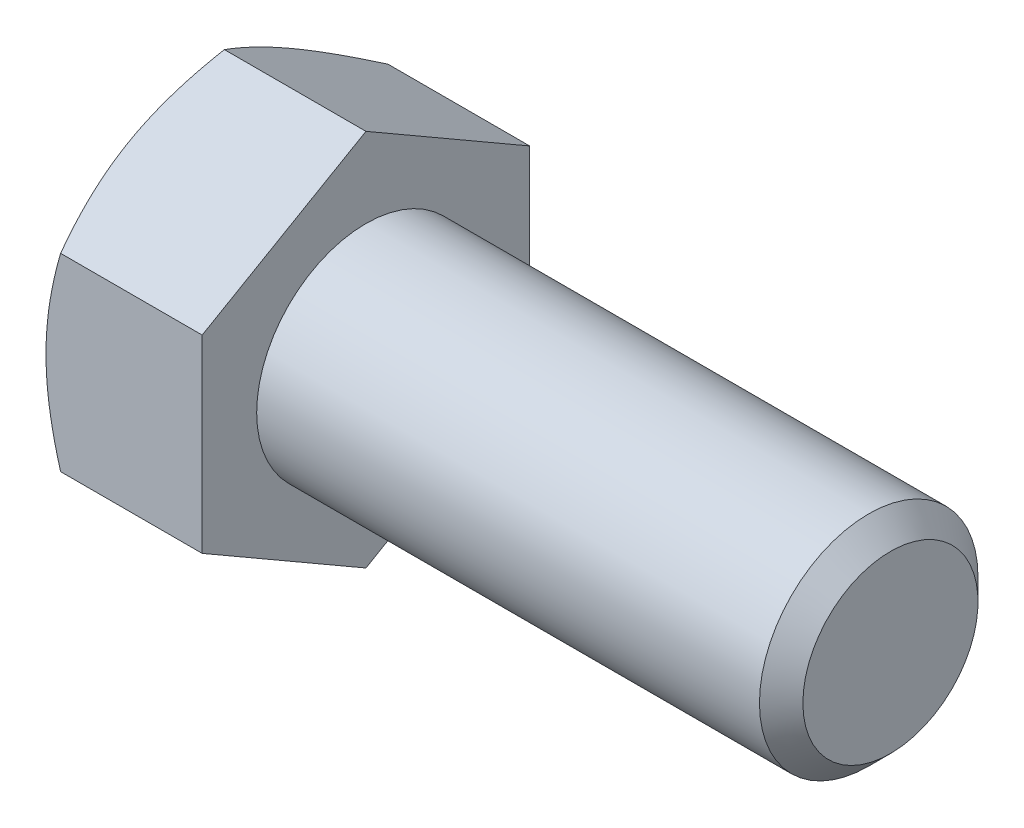
ISO-10303-21;
HEADER;
FILE_DESCRIPTION(('STEP AP214'),'2;1');
FILE_NAME('part.step','',(''),(''),'','','');
FILE_SCHEMA(('AUTOMOTIVE_DESIGN { 1 0 10303 214 1 1 1 1 }'));
ENDSEC;
DATA;
#1=APPLICATION_CONTEXT('core data for automotive mechanical design processes');
#2=APPLICATION_PROTOCOL_DEFINITION('international standard','automotive_design',2000,#1);
#3=PRODUCT_CONTEXT('',#1,'mechanical');
#4=PRODUCT('Part','Part','',(#3));
#5=PRODUCT_RELATED_PRODUCT_CATEGORY('part','',(#4));
#6=PRODUCT_DEFINITION_FORMATION('','',#4);
#7=PRODUCT_DEFINITION_CONTEXT('part definition',#1,'design');
#8=PRODUCT_DEFINITION('design','',#6,#7);
#9=PRODUCT_DEFINITION_SHAPE('','',#8);
#10=(LENGTH_UNIT() NAMED_UNIT(*) SI_UNIT(.MILLI.,.METRE.));
#11=(NAMED_UNIT(*) PLANE_ANGLE_UNIT() SI_UNIT($,.RADIAN.));
#12=(NAMED_UNIT(*) SI_UNIT($,.STERADIAN.) SOLID_ANGLE_UNIT());
#13=UNCERTAINTY_MEASURE_WITH_UNIT(LENGTH_MEASURE(1.E-05),#10,'distance_accuracy_value','');
#14=(GEOMETRIC_REPRESENTATION_CONTEXT(3) GLOBAL_UNCERTAINTY_ASSIGNED_CONTEXT((#13)) GLOBAL_UNIT_ASSIGNED_CONTEXT((#10,
#11,#12)) REPRESENTATION_CONTEXT('',''));
#15=CARTESIAN_POINT('',(0.,0.,0.));
#16=DIRECTION('',(0.,0.,1.));
#17=DIRECTION('',(1.,0.,0.));
#18=AXIS2_PLACEMENT_3D('',#15,#16,#17);
#19=CARTESIAN_POINT('',(6.8072,4.12077981131403,-7.1374));
#20=DIRECTION('',(0.,-0.866025403784438,0.500000000000001));
#21=DIRECTION('',(0.,-0.500000000000001,-0.866025403784438));
#22=AXIS2_PLACEMENT_3D('',#19,#20,#21);
#23=PLANE('',#22);
#24=CARTESIAN_POINT('',(0.637553523420348,8.24167509268191,0.000199999999999582));
#25=CARTESIAN_POINT('',(0.585265389565359,8.15109571898021,-0.156688077369111));
#26=CARTESIAN_POINT('',(0.535350289912886,8.06017862158373,-0.314161109336512));
#27=CARTESIAN_POINT('',(0.440919739394811,7.87760608276958,-0.630386022629451));
#28=CARTESIAN_POINT('',(0.396406617864103,7.78595034088604,-0.789138424377166));
#29=CARTESIAN_POINT('',(0.2718439466046,7.50951559742938,-1.26793744502137));
#30=CARTESIAN_POINT('',(0.200994122533562,7.32364541554993,-1.58987404364865));
#31=CARTESIAN_POINT('',(0.117914357261567,7.04549407114397,-2.07164630435335));
#32=CARTESIAN_POINT('',(0.0942473375753679,6.95404399131372,-2.23004248897558));
#33=CARTESIAN_POINT('',(0.0545611977075647,6.77073061920728,-2.54755056317072));
#34=CARTESIAN_POINT('',(0.0385414017966341,6.67886736416472,-2.70666238825308));
#35=CARTESIAN_POINT('',(0.0145579786669824,6.49498130931768,-3.02516237805154));
#36=CARTESIAN_POINT('',(0.00658520869042867,6.40295880983915,-3.18455002258784));
#37=CARTESIAN_POINT('',(-0.00114175893561541,6.21883388819856,-3.50346374180898));
#38=CARTESIAN_POINT('',(-0.000896210482461266,6.12673146859347,-3.66298981206503));
#39=CARTESIAN_POINT('',(0.0110730517201773,5.87440161908354,-4.10003793168242));
#40=CARTESIAN_POINT('',(0.0311658852990926,5.71425679021456,-4.37741691185292));
#41=CARTESIAN_POINT('',(0.0948800883359072,5.39503079963205,-4.93033254663834));
#42=CARTESIAN_POINT('',(0.13852323430896,5.23595076056063,-5.20586725678008));
#43=CARTESIAN_POINT('',(0.247618299095075,4.91608234409664,-5.75989560583231));
#44=CARTESIAN_POINT('',(0.31353243599271,4.75533432745402,-6.03831933787326));
#45=CARTESIAN_POINT('',(0.463130880450463,4.43623548204411,-6.59101475075978));
#46=CARTESIAN_POINT('',(0.546780048637372,4.27788056676996,-6.86529350964288));
#47=CARTESIAN_POINT('',(0.637553523420343,4.12066434126019,-7.1376));
#48=B_SPLINE_CURVE_WITH_KNOTS('',3,(#24,#25,#26,#27,#28,#29,#30,#31,#32,#33,#34,#35,#36,#37,#38,
#39,#40,#41,#42,#43,#44,#45,#46,#47),.UNSPECIFIED.,.F.,.F.,(4,2,2,2,2,2,2,2,2,2,2,4),(0.,
0.565616271543687,1.13147557690344,2.26554547664276,2.81869146049269,3.37178855781927,
3.9242565351942,4.47670744459711,5.43845614829341,6.40109569003608,7.3850851165131,
8.36714283329691),.UNSPECIFIED.);
#49=CARTESIAN_POINT('',(0.637486855352631,8.24155962262808,0.));
#50=VERTEX_POINT('',#49);
#51=CARTESIAN_POINT('',(0.,6.18116971697105,-3.56870000000001));
#52=VERTEX_POINT('',#51);
#53=EDGE_CURVE('E51',#50,#52,#48,.T.);
#54=ORIENTED_EDGE('',*,*,#53,.F.);
#55=DIRECTION('',(-1.,0.,0.));
#56=VECTOR('',#55,1.);
#57=CARTESIAN_POINT('',(6.8072,8.24155962262808,0.));
#58=LINE('',#57,#56);
#59=CARTESIAN_POINT('',(6.8072,8.24155962262808,0.));
#60=VERTEX_POINT('',#59);
#61=EDGE_CURVE('E147',#60,#50,#58,.T.);
#62=ORIENTED_EDGE('',*,*,#61,.F.);
#63=DIRECTION('',(0.,0.500000000000001,0.866025403784438));
#64=VECTOR('',#63,1.);
#65=CARTESIAN_POINT('',(6.8072,4.12077981131403,-7.1374));
#66=LINE('',#65,#64);
#67=CARTESIAN_POINT('',(6.8072,4.12077981131403,-7.1374));
#68=VERTEX_POINT('',#67);
#69=EDGE_CURVE('E232',#68,#60,#66,.T.);
#70=ORIENTED_EDGE('',*,*,#69,.F.);
#71=DIRECTION('',(-1.,0.,0.));
#72=VECTOR('',#71,1.);
#73=CARTESIAN_POINT('',(6.8072,4.12077981131403,-7.1374));
#74=LINE('',#73,#72);
#75=CARTESIAN_POINT('',(0.637486855352625,4.12077981131403,-7.1374));
#76=VERTEX_POINT('',#75);
#77=EDGE_CURVE('E135',#68,#76,#74,.T.);
#78=ORIENTED_EDGE('',*,*,#77,.T.);
#79=EDGE_CURVE('E129',#52,#76,#48,.T.);
#80=ORIENTED_EDGE('',*,*,#79,.F.);
#81=EDGE_LOOP('',(#54,#62,#70,#78,#80));
#82=FACE_BOUND('',#81,.T.);
#83=ADVANCED_FACE('F35',(#82),#23,.F.);
#84=CARTESIAN_POINT('',(6.8072,8.24155962262808,0.));
#85=DIRECTION('',(0.,-0.866025403784438,-0.500000000000001));
#86=DIRECTION('',(0.,0.500000000000001,-0.866025403784438));
#87=AXIS2_PLACEMENT_3D('',#84,#85,#86);
#88=PLANE('',#87);
#89=CARTESIAN_POINT('',(0.637553523420344,4.12066434126019,7.1376));
#90=CARTESIAN_POINT('',(0.585265389565354,4.21124371496189,6.98071192263089));
#91=CARTESIAN_POINT('',(0.535350289912882,4.30216081235838,6.82323889066349));
#92=CARTESIAN_POINT('',(0.440919739394807,4.48473335117252,6.50701397737055));
#93=CARTESIAN_POINT('',(0.3964066178641,4.57638909305606,6.34826157562283));
#94=CARTESIAN_POINT('',(0.271843946604597,4.85282383651273,5.86946255497863));
#95=CARTESIAN_POINT('',(0.20099412253356,5.03869401839218,5.54752595635135));
#96=CARTESIAN_POINT('',(0.117914357261566,5.31684536279814,5.06575369564665));
#97=CARTESIAN_POINT('',(0.094247337575367,5.40829544262839,4.90735751102442));
#98=CARTESIAN_POINT('',(0.0545611977075641,5.59160881473483,4.58984943682928));
#99=CARTESIAN_POINT('',(0.0385414017966333,5.68347206977738,4.43073761174692));
#100=CARTESIAN_POINT('',(0.0145579786669821,5.86735812462442,4.11223762194846));
#101=CARTESIAN_POINT('',(0.00658520869042904,5.95938062410295,3.95284997741216));
#102=CARTESIAN_POINT('',(-0.00114175893561427,6.14350554574354,3.63393625819102));
#103=CARTESIAN_POINT('',(-0.000896210482460006,6.23560796534864,3.47441018793497));
#104=CARTESIAN_POINT('',(0.0110730517201789,6.48793781485856,3.03736206831758));
#105=CARTESIAN_POINT('',(0.0311658852990944,6.64808264372754,2.75998308814708));
#106=CARTESIAN_POINT('',(0.0948800883359096,6.96730863431005,2.20706745336167));
#107=CARTESIAN_POINT('',(0.138523234308963,7.12638867338148,1.93153274321992));
#108=CARTESIAN_POINT('',(0.24761829909508,7.44625708984546,1.37750439416769));
#109=CARTESIAN_POINT('',(0.313532435992716,7.60700510648809,1.09908066212674));
#110=CARTESIAN_POINT('',(0.463130880450469,7.926103951898,0.546385249240216));
#111=CARTESIAN_POINT('',(0.546780048637379,8.08445886717215,0.272106490357122));
#112=CARTESIAN_POINT('',(0.637553523420349,8.24167509268191,-0.000199999999999955));
#113=B_SPLINE_CURVE_WITH_KNOTS('',3,(#89,#90,#91,#92,#93,#94,#95,#96,#97,#98,#99,#100,#101,#102,
#103,#104,#105,#106,#107,#108,#109,#110,#111,#112),.UNSPECIFIED.,.F.,.F.,(4,2,2,2,2,2,2,2,2,2,2,
4),(0.,0.565616271543686,1.13147557690344,2.26554547664276,2.81869146049269,3.37178855781927,
3.92425653519419,4.4767074445971,5.4384561482934,6.40109569003607,7.3850851165131,
8.36714283329691),.UNSPECIFIED.);
#114=CARTESIAN_POINT('',(0.637486855352626,4.12077981131403,7.1374));
#115=VERTEX_POINT('',#114);
#116=CARTESIAN_POINT('',(0.,6.18116971697105,3.56870000000001));
#117=VERTEX_POINT('',#116);
#118=EDGE_CURVE('E58',#115,#117,#113,.T.);
#119=ORIENTED_EDGE('',*,*,#118,.F.);
#120=DIRECTION('',(-1.,0.,0.));
#121=VECTOR('',#120,1.);
#122=CARTESIAN_POINT('',(6.8072,4.12077981131403,7.1374));
#123=LINE('',#122,#121);
#124=CARTESIAN_POINT('',(6.8072,4.12077981131403,7.1374));
#125=VERTEX_POINT('',#124);
#126=EDGE_CURVE('E145',#125,#115,#123,.T.);
#127=ORIENTED_EDGE('',*,*,#126,.F.);
#128=DIRECTION('',(0.,-0.500000000000001,0.866025403784438));
#129=VECTOR('',#128,1.);
#130=CARTESIAN_POINT('',(6.8072,8.24155962262808,0.));
#131=LINE('',#130,#129);
#132=EDGE_CURVE('E230',#60,#125,#131,.T.);
#133=ORIENTED_EDGE('',*,*,#132,.F.);
#134=ORIENTED_EDGE('',*,*,#61,.T.);
#135=EDGE_CURVE('E162',#117,#50,#113,.T.);
#136=ORIENTED_EDGE('',*,*,#135,.F.);
#137=EDGE_LOOP('',(#119,#127,#133,#134,#136));
#138=FACE_BOUND('',#137,.T.);
#139=ADVANCED_FACE('F168',(#138),#88,.F.);
#140=CARTESIAN_POINT('',(6.8072,4.12077981131403,7.1374));
#141=DIRECTION('',(0.,0.,-1.));
#142=DIRECTION('',(-1.,0.,0.));
#143=AXIS2_PLACEMENT_3D('',#140,#141,#142);
#144=PLANE('',#143);
#145=CARTESIAN_POINT('',(3.51793891464087,-11.1403587268437,7.1374));
#146=CARTESIAN_POINT('',(3.36611761361542,-10.8279722926893,7.1374));
#147=CARTESIAN_POINT('',(3.21573167435817,-10.5148763007017,7.1374));
#148=CARTESIAN_POINT('',(2.91863653133452,-9.88688803265219,7.1374));
#149=CARTESIAN_POINT('',(2.77192789362364,-9.57199548909054,7.1374));
#150=CARTESIAN_POINT('',(2.48227074397641,-8.93844907707202,7.1374));
#151=CARTESIAN_POINT('',(2.33934643030355,-8.61978410734441,7.1374));
#152=CARTESIAN_POINT('',(2.05925336317275,-7.97994405772779,7.1374));
#153=CARTESIAN_POINT('',(1.92208434228597,-7.65876909529408,7.1374));
#154=CARTESIAN_POINT('',(1.65065378230837,-7.00284865103085,7.1374));
#155=CARTESIAN_POINT('',(1.51663374065787,-6.66800268560584,7.1374));
#156=CARTESIAN_POINT('',(1.25856485288051,-5.99442084818065,7.1374));
#157=CARTESIAN_POINT('',(1.13451711533335,-5.6556845484785,7.1374));
#158=CARTESIAN_POINT('',(0.899596727677592,-4.97438980758155,7.1374));
#159=CARTESIAN_POINT('',(0.78869803674292,-4.63184044199148,7.1374));
#160=CARTESIAN_POINT('',(0.583585288609215,-3.94184101121261,7.1374));
#161=CARTESIAN_POINT('',(0.489366053461915,-3.5943925031972,7.1374));
#162=CARTESIAN_POINT('',(0.322585119775289,-2.89623643412328,7.1374));
#163=CARTESIAN_POINT('',(0.249906108267923,-2.54555766855628,7.1374));
#164=CARTESIAN_POINT('',(0.160162927876226,-2.01629019056175,7.1374));
#165=CARTESIAN_POINT('',(0.133459926561135,-1.83931395899738,7.1374));
#166=CARTESIAN_POINT('',(0.0870009608751859,-1.48445773938035,7.1374));
#167=CARTESIAN_POINT('',(0.0672443235865576,-1.3065778405635,7.1374));
#168=CARTESIAN_POINT('',(0.0353233928817906,-0.952509042934671,7.1374));
#169=CARTESIAN_POINT('',(0.023062060656036,-0.776328928434241,7.1374));
#170=CARTESIAN_POINT('',(0.00600431660240745,-0.423607840789669,7.1374));
#171=CARTESIAN_POINT('',(0.00120777872271182,-0.247066873789353,7.1374));
#172=CARTESIAN_POINT('',(-0.000805707966080717,0.106061109313543,7.1374));
#173=CARTESIAN_POINT('',(0.00197740745485924,0.282648125793668,7.1374));
#174=CARTESIAN_POINT('',(0.015054364225325,0.635545980126708,7.1374));
#175=CARTESIAN_POINT('',(0.0253485677088154,0.811856804252741,7.1374));
#176=CARTESIAN_POINT('',(0.0587173546676621,1.23335791869126,7.1374));
#177=CARTESIAN_POINT('',(0.0852317102922988,1.47828183508495,7.1374));
#178=CARTESIAN_POINT('',(0.151325348901078,1.96634766484074,7.1374));
#179=CARTESIAN_POINT('',(0.190906342916657,2.20948934056,7.1374));
#180=CARTESIAN_POINT('',(0.327153349211707,2.93593608611635,7.1374));
#181=CARTESIAN_POINT('',(0.441300495017733,3.41600789467397,7.1374));
#182=CARTESIAN_POINT('',(0.639740105584513,4.13409780337111,7.1374));
#183=CARTESIAN_POINT('',(0.71138683927974,4.37582477933243,7.1374));
#184=CARTESIAN_POINT('',(0.862240726867138,4.85693123459408,7.1374));
#185=CARTESIAN_POINT('',(0.941447936163006,5.09631069667749,7.1374));
#186=CARTESIAN_POINT('',(1.10614180608764,5.57279746249284,7.1374));
#187=CARTESIAN_POINT('',(1.19162653724197,5.809905439274,7.1374));
#188=CARTESIAN_POINT('',(1.36785754588297,6.28214651090287,7.1374));
#189=CARTESIAN_POINT('',(1.4586037216663,6.51727964382365,7.1374));
#190=CARTESIAN_POINT('',(1.70099135878086,7.12822933634872,7.1374));
#191=CARTESIAN_POINT('',(1.85611245200932,7.50266378649049,7.1374));
#192=CARTESIAN_POINT('',(2.17492034788947,8.24788094227112,7.1374));
#193=CARTESIAN_POINT('',(2.338607954525,8.61866330125998,7.1374));
#194=CARTESIAN_POINT('',(2.67260301704527,9.35737269718075,7.1374));
#195=CARTESIAN_POINT('',(2.8429126440593,9.7252987493811,7.1374));
#196=CARTESIAN_POINT('',(3.18863367809308,10.4587232704181,7.1374));
#197=CARTESIAN_POINT('',(3.36404491157502,10.8242218213112,7.1374));
#198=CARTESIAN_POINT('',(3.7191549662705,11.553777334436,7.1374));
#199=CARTESIAN_POINT('',(3.89885959822867,11.9178314626509,7.1374));
#200=CARTESIAN_POINT('',(4.26150568432078,12.6443245246618,7.1374));
#201=CARTESIAN_POINT('',(4.44444716083244,13.0067634472695,7.1374));
#202=CARTESIAN_POINT('',(4.81291716764717,13.7302353242129,7.1374));
#203=CARTESIAN_POINT('',(4.99844519827985,14.0912685333268,7.1374));
#204=CARTESIAN_POINT('',(5.37165471040538,14.8122208146436,7.1374));
#205=CARTESIAN_POINT('',(5.55933620037512,15.1721398824536,7.1374));
#206=CARTESIAN_POINT('',(6.08751400276291,16.1789579520409,7.1374));
#207=CARTESIAN_POINT('',(6.43000254365915,16.8248116492745,7.1374));
#208=CARTESIAN_POINT('',(7.11919785487999,18.1143032770824,7.1374));
#209=CARTESIAN_POINT('',(7.46590484738288,18.7579410886393,7.1374));
#210=CARTESIAN_POINT('',(8.16140637459832,20.0415314633598,7.1374));
#211=CARTESIAN_POINT('',(8.51019123426674,20.6814892741016,7.1374));
#212=CARTESIAN_POINT('',(9.21019417047445,21.9600146152104,7.1374));
#213=CARTESIAN_POINT('',(9.56141207357471,22.598582240497,7.1374));
#214=CARTESIAN_POINT('',(9.9135191344137,23.2366555668876,7.1374));
#215=B_SPLINE_CURVE_WITH_KNOTS('',3,(#145,#146,#147,#148,#149,#150,#151,#152,#153,#154,#155,
#156,#157,#158,#159,#160,#161,#162,#163,#164,#165,#166,#167,#168,#169,#170,#171,#172,#173,#174,
#175,#176,#177,#178,#179,#180,#181,#182,#183,#184,#185,#186,#187,#188,#189,#190,#191,#192,#193,
#194,#195,#196,#197,#198,#199,#200,#201,#202,#203,#204,#205,#206,#207,#208,#209,#210,#211,#212,
#213,#214),.UNSPECIFIED.,.F.,.F.,(4,2,2,2,2,2,2,2,2,2,2,2,2,2,2,2,2,2,2,2,2,2,2,2,2,2,2,2,2,2,2,
2,2,2,4),(0.,1.0419888362068,2.08413709519682,3.13183784368231,4.17948985504911,
5.26137797247103,6.34338619307611,7.42321444996099,8.50270689628368,9.57620733057732,
10.113030795566,10.6498022423129,11.179468394122,11.7091256017988,12.2387872978086,
12.7684745322176,13.5071235743819,14.245869378494,15.7241255438818,16.4804246089875,
17.2367292167316,17.9928023300467,18.7488608333938,19.9645892594812,21.1804319893616,
22.3966767697582,23.6128802262777,24.8308351286452,26.0487984545624,27.2665296678531,
28.4842656762731,30.6773737382255,32.8705978115956,35.0570894097064,37.2434267159856),.UNSPECIFIED.);
#216=CARTESIAN_POINT('',(0.637486855352626,-4.12077981131403,7.1374));
#217=VERTEX_POINT('',#216);
#218=CARTESIAN_POINT('',(0.,0.,7.1374));
#219=VERTEX_POINT('',#218);
#220=EDGE_CURVE('E242',#217,#219,#215,.T.);
#221=ORIENTED_EDGE('',*,*,#220,.F.);
#222=DIRECTION('',(-1.,0.,0.));
#223=VECTOR('',#222,1.);
#224=CARTESIAN_POINT('',(6.8072,-4.12077981131403,7.1374));
#225=LINE('',#224,#223);
#226=CARTESIAN_POINT('',(6.8072,-4.12077981131403,7.1374));
#227=VERTEX_POINT('',#226);
#228=EDGE_CURVE('E137',#227,#217,#225,.T.);
#229=ORIENTED_EDGE('',*,*,#228,.F.);
#230=DIRECTION('',(0.,-1.,0.));
#231=VECTOR('',#230,1.);
#232=CARTESIAN_POINT('',(6.8072,4.12077981131403,7.1374));
#233=LINE('',#232,#231);
#234=EDGE_CURVE('E226',#125,#227,#233,.T.);
#235=ORIENTED_EDGE('',*,*,#234,.F.);
#236=ORIENTED_EDGE('',*,*,#126,.T.);
#237=EDGE_CURVE('E184',#219,#115,#215,.T.);
#238=ORIENTED_EDGE('',*,*,#237,.F.);
#239=EDGE_LOOP('',(#221,#229,#235,#236,#238));
#240=FACE_BOUND('',#239,.T.);
#241=ADVANCED_FACE('F248',(#240),#144,.F.);
#242=CARTESIAN_POINT('',(6.8072,-8.24155962262808,0.));
#243=DIRECTION('',(0.,0.866025403784438,-0.500000000000002));
#244=DIRECTION('',(0.,0.500000000000002,0.866025403784438));
#245=AXIS2_PLACEMENT_3D('',#242,#243,#244);
#246=PLANE('',#245);
#247=CARTESIAN_POINT('',(0.637553523420353,-8.24167509268192,-0.000200000000000067));
#248=CARTESIAN_POINT('',(0.585265389565364,-8.15109571898022,0.15668807736911));
#249=CARTESIAN_POINT('',(0.535350289912891,-8.06017862158374,0.314161109336512));
#250=CARTESIAN_POINT('',(0.440919739394815,-7.87760608276959,0.63038602262945));
#251=CARTESIAN_POINT('',(0.396406617864107,-7.78595034088605,0.789138424377166));
#252=CARTESIAN_POINT('',(0.271843946604603,-7.50951559742939,1.26793744502137));
#253=CARTESIAN_POINT('',(0.200994122533565,-7.32364541554993,1.58987404364865));
#254=CARTESIAN_POINT('',(0.11791435726157,-7.04549407114397,2.07164630435335));
#255=CARTESIAN_POINT('',(0.0942473375753707,-6.95404399131372,2.23004248897558));
#256=CARTESIAN_POINT('',(0.0545611977075674,-6.77073061920728,2.54755056317072));
#257=CARTESIAN_POINT('',(0.0385414017966367,-6.67886736416473,2.70666238825308));
#258=CARTESIAN_POINT('',(0.0145579786669845,-6.49498130931769,3.02516237805154));
#259=CARTESIAN_POINT('',(0.00658520869043039,-6.40295880983915,3.18455002258784));
#260=CARTESIAN_POINT('',(-0.00114175893561386,-6.21883388819856,3.50346374180898));
#261=CARTESIAN_POINT('',(-0.000896210482459503,-6.12673146859347,3.66298981206503));
#262=CARTESIAN_POINT('',(0.011073051720179,-5.87440161908355,4.10003793168242));
#263=CARTESIAN_POINT('',(0.0311658852990936,-5.71425679021456,4.37741691185292));
#264=CARTESIAN_POINT('',(0.0948800883359078,-5.39503079963205,4.93033254663834));
#265=CARTESIAN_POINT('',(0.138523234308961,-5.23595076056063,5.20586725678008));
#266=CARTESIAN_POINT('',(0.247618299095076,-4.91608234409664,5.75989560583231));
#267=CARTESIAN_POINT('',(0.313532435992711,-4.75533432745402,6.03831933787326));
#268=CARTESIAN_POINT('',(0.463130880450463,-4.43623548204411,6.59101475075978));
#269=CARTESIAN_POINT('',(0.546780048637372,-4.27788056676996,6.86529350964288));
#270=CARTESIAN_POINT('',(0.637553523420342,-4.12066434126019,7.1376));
#271=B_SPLINE_CURVE_WITH_KNOTS('',3,(#247,#248,#249,#250,#251,#252,#253,#254,#255,#256,#257,
#258,#259,#260,#261,#262,#263,#264,#265,#266,#267,#268,#269,#270),.UNSPECIFIED.,.F.,.F.,(4,2,2,
2,2,2,2,2,2,2,2,4),(0.,0.565616271543688,1.13147557690344,2.26554547664277,2.81869146049269,
3.37178855781927,3.9242565351942,4.47670744459711,5.43845614829341,6.40109569003608,
7.38508511651311,8.36714283329692),.UNSPECIFIED.);
#272=CARTESIAN_POINT('',(0.637486855352636,-8.24155962262808,0.));
#273=VERTEX_POINT('',#272);
#274=CARTESIAN_POINT('',(0.,-6.18116971697104,3.56870000000001));
#275=VERTEX_POINT('',#274);
#276=EDGE_CURVE('E170',#273,#275,#271,.T.);
#277=ORIENTED_EDGE('',*,*,#276,.F.);
#278=DIRECTION('',(-1.,0.,0.));
#279=VECTOR('',#278,1.);
#280=CARTESIAN_POINT('',(6.8072,-8.24155962262808,0.));
#281=LINE('',#280,#279);
#282=CARTESIAN_POINT('',(6.8072,-8.24155962262808,0.));
#283=VERTEX_POINT('',#282);
#284=EDGE_CURVE('E134',#283,#273,#281,.T.);
#285=ORIENTED_EDGE('',*,*,#284,.F.);
#286=DIRECTION('',(0.,-0.500000000000002,-0.866025403784438));
#287=VECTOR('',#286,1.);
#288=CARTESIAN_POINT('',(6.8072,-8.24155962262808,0.));
#289=LINE('',#288,#287);
#290=EDGE_CURVE('E224',#227,#283,#289,.T.);
#291=ORIENTED_EDGE('',*,*,#290,.F.);
#292=ORIENTED_EDGE('',*,*,#228,.T.);
#293=EDGE_CURVE('E172',#275,#217,#271,.T.);
#294=ORIENTED_EDGE('',*,*,#293,.F.);
#295=EDGE_LOOP('',(#277,#285,#291,#292,#294));
#296=FACE_BOUND('',#295,.T.);
#297=ADVANCED_FACE('F220',(#296),#246,.F.);
#298=CARTESIAN_POINT('',(6.8072,-4.12077981131404,-7.1374));
#299=DIRECTION('',(0.,0.866025403784438,0.500000000000001));
#300=DIRECTION('',(0.,-0.500000000000001,0.866025403784438));
#301=AXIS2_PLACEMENT_3D('',#298,#299,#300);
#302=PLANE('',#301);
#303=CARTESIAN_POINT('',(0.637553523420347,-4.12066434126021,-7.1376));
#304=CARTESIAN_POINT('',(0.585265389565358,-4.2112437149619,-6.98071192263089));
#305=CARTESIAN_POINT('',(0.535350289912886,-4.30216081235839,-6.82323889066349));
#306=CARTESIAN_POINT('',(0.440919739394811,-4.48473335117254,-6.50701397737055));
#307=CARTESIAN_POINT('',(0.396406617864103,-4.57638909305608,-6.34826157562283));
#308=CARTESIAN_POINT('',(0.271843946604601,-4.85282383651274,-5.86946255497863));
#309=CARTESIAN_POINT('',(0.200994122533564,-5.03869401839219,-5.54752595635135));
#310=CARTESIAN_POINT('',(0.11791435726157,-5.31684536279815,-5.06575369564664));
#311=CARTESIAN_POINT('',(0.0942473375753706,-5.4082954426284,-4.90735751102441));
#312=CARTESIAN_POINT('',(0.0545611977075683,-5.59160881473484,-4.58984943682928));
#313=CARTESIAN_POINT('',(0.0385414017966383,-5.68347206977739,-4.43073761174692));
#314=CARTESIAN_POINT('',(0.0145579786669876,-5.86735812462443,-4.11223762194845));
#315=CARTESIAN_POINT('',(0.00658520869043416,-5.95938062410297,-3.95284997741216));
#316=CARTESIAN_POINT('',(-0.00114175893560937,-6.14350554574356,-3.63393625819102));
#317=CARTESIAN_POINT('',(-0.000896210482454987,-6.23560796534865,-3.47441018793497));
#318=CARTESIAN_POINT('',(0.0110730517201842,-6.48793781485857,-3.03736206831757));
#319=CARTESIAN_POINT('',(0.0311658852990998,-6.64808264372755,-2.75998308814708));
#320=CARTESIAN_POINT('',(0.0948800883359153,-6.96730863431006,-2.20706745336166));
#321=CARTESIAN_POINT('',(0.138523234308969,-7.12638867338149,-1.93153274321992));
#322=CARTESIAN_POINT('',(0.247618299095085,-7.44625708984547,-1.37750439416769));
#323=CARTESIAN_POINT('',(0.313532435992721,-7.6070051064881,-1.09908066212674));
#324=CARTESIAN_POINT('',(0.463130880450474,-7.92610395189801,-0.546385249240215));
#325=CARTESIAN_POINT('',(0.546780048637383,-8.08445886717216,-0.272106490357122));
#326=CARTESIAN_POINT('',(0.637553523420353,-8.24167509268192,0.000200000000000249));
#327=B_SPLINE_CURVE_WITH_KNOTS('',3,(#303,#304,#305,#306,#307,#308,#309,#310,#311,#312,#313,
#314,#315,#316,#317,#318,#319,#320,#321,#322,#323,#324,#325,#326),.UNSPECIFIED.,.F.,.F.,(4,2,2,
2,2,2,2,2,2,2,2,4),(0.,0.565616271543688,1.13147557690344,2.26554547664276,2.81869146049269,
3.37178855781927,3.9242565351942,4.4767074445971,5.43845614829341,6.40109569003607,
7.3850851165131,8.36714283329691),.UNSPECIFIED.);
#328=CARTESIAN_POINT('',(0.63748685535263,-4.12077981131404,-7.1374));
#329=VERTEX_POINT('',#328);
#330=CARTESIAN_POINT('',(0.,-6.18116971697105,-3.5687));
#331=VERTEX_POINT('',#330);
#332=EDGE_CURVE('E111',#329,#331,#327,.T.);
#333=ORIENTED_EDGE('',*,*,#332,.F.);
#334=DIRECTION('',(-1.,0.,0.));
#335=VECTOR('',#334,1.);
#336=CARTESIAN_POINT('',(6.8072,-4.12077981131404,-7.1374));
#337=LINE('',#336,#335);
#338=CARTESIAN_POINT('',(6.8072,-4.12077981131404,-7.1374));
#339=VERTEX_POINT('',#338);
#340=EDGE_CURVE('E125',#339,#329,#337,.T.);
#341=ORIENTED_EDGE('',*,*,#340,.F.);
#342=DIRECTION('',(0.,0.500000000000001,-0.866025403784438));
#343=VECTOR('',#342,1.);
#344=CARTESIAN_POINT('',(6.8072,-4.12077981131404,-7.1374));
#345=LINE('',#344,#343);
#346=EDGE_CURVE('E222',#283,#339,#345,.T.);
#347=ORIENTED_EDGE('',*,*,#346,.F.);
#348=ORIENTED_EDGE('',*,*,#284,.T.);
#349=EDGE_CURVE('E128',#331,#273,#327,.T.);
#350=ORIENTED_EDGE('',*,*,#349,.F.);
#351=EDGE_LOOP('',(#333,#341,#347,#348,#350));
#352=FACE_BOUND('',#351,.T.);
#353=ADVANCED_FACE('F123',(#352),#302,.F.);
#354=CARTESIAN_POINT('',(6.8072,4.12077981131403,-7.1374));
#355=DIRECTION('',(0.,0.,1.));
#356=DIRECTION('',(1.,0.,0.));
#357=AXIS2_PLACEMENT_3D('',#354,#355,#356);
#358=PLANE('',#357);
#359=CARTESIAN_POINT('',(3.51793891464088,-11.1403587268438,-7.1374));
#360=CARTESIAN_POINT('',(3.36611761361543,-10.8279722926893,-7.1374));
#361=CARTESIAN_POINT('',(3.21573167435818,-10.5148763007017,-7.1374));
#362=CARTESIAN_POINT('',(2.91863653133453,-9.88688803265221,-7.1374));
#363=CARTESIAN_POINT('',(2.77192789362365,-9.57199548909056,-7.1374));
#364=CARTESIAN_POINT('',(2.48227074397642,-8.93844907707204,-7.1374));
#365=CARTESIAN_POINT('',(2.33934643030356,-8.61978410734443,-7.1374));
#366=CARTESIAN_POINT('',(2.05925336317276,-7.97994405772781,-7.1374));
#367=CARTESIAN_POINT('',(1.92208434228598,-7.65876909529411,-7.1374));
#368=CARTESIAN_POINT('',(1.65065378230838,-7.00284865103087,-7.1374));
#369=CARTESIAN_POINT('',(1.51663374065788,-6.66800268560586,-7.1374));
#370=CARTESIAN_POINT('',(1.25856485288051,-5.99442084818067,-7.1374));
#371=CARTESIAN_POINT('',(1.13451711533335,-5.65568454847852,-7.1374));
#372=CARTESIAN_POINT('',(0.899596727677598,-4.97438980758156,-7.1374));
#373=CARTESIAN_POINT('',(0.788698036742925,-4.6318404419915,-7.1374));
#374=CARTESIAN_POINT('',(0.583585288609219,-3.94184101121262,-7.1374));
#375=CARTESIAN_POINT('',(0.489366053461919,-3.59439250319721,-7.1374));
#376=CARTESIAN_POINT('',(0.322585119775292,-2.8962364341233,-7.1374));
#377=CARTESIAN_POINT('',(0.249906108267925,-2.54555766855629,-7.1374));
#378=CARTESIAN_POINT('',(0.160162927876228,-2.01629019056176,-7.1374));
#379=CARTESIAN_POINT('',(0.133459926561136,-1.8393139589974,-7.1374));
#380=CARTESIAN_POINT('',(0.0870009608751871,-1.48445773938036,-7.1374));
#381=CARTESIAN_POINT('',(0.0672443235865584,-1.30657784056351,-7.1374));
#382=CARTESIAN_POINT('',(0.0353233928817909,-0.952509042934684,-7.1374));
#383=CARTESIAN_POINT('',(0.0230620606560362,-0.776328928434254,-7.1374));
#384=CARTESIAN_POINT('',(0.0060043166024073,-0.423607840789682,-7.1374));
#385=CARTESIAN_POINT('',(0.00120777872271151,-0.247066873789366,-7.1374));
#386=CARTESIAN_POINT('',(-0.000805707966081406,0.10606110931353,-7.1374));
#387=CARTESIAN_POINT('',(0.00197740745485832,0.282648125793655,-7.1374));
#388=CARTESIAN_POINT('',(0.0150543642253239,0.635545980126695,-7.1374));
#389=CARTESIAN_POINT('',(0.0253485677088145,0.811856804252728,-7.1374));
#390=CARTESIAN_POINT('',(0.058717354667661,1.23335791869125,-7.1374));
#391=CARTESIAN_POINT('',(0.0852317102922972,1.47828183508493,-7.1374));
#392=CARTESIAN_POINT('',(0.151325348901076,1.96634766484072,-7.1374));
#393=CARTESIAN_POINT('',(0.190906342916654,2.20948934055998,-7.1374));
#394=CARTESIAN_POINT('',(0.327153349211703,2.93593608611633,-7.1374));
#395=CARTESIAN_POINT('',(0.441300495017729,3.41600789467395,-7.1374));
#396=CARTESIAN_POINT('',(0.639740105584508,4.13409780337109,-7.1374));
#397=CARTESIAN_POINT('',(0.711386839279735,4.37582477933241,-7.1374));
#398=CARTESIAN_POINT('',(0.862240726867132,4.85693123459407,-7.1374));
#399=CARTESIAN_POINT('',(0.941447936163,5.09631069667747,-7.1374));
#400=CARTESIAN_POINT('',(1.10614180608763,5.57279746249282,-7.1374));
#401=CARTESIAN_POINT('',(1.19162653724196,5.80990543927398,-7.1374));
#402=CARTESIAN_POINT('',(1.36785754588296,6.28214651090285,-7.1374));
#403=CARTESIAN_POINT('',(1.4586037216663,6.51727964382363,-7.1374));
#404=CARTESIAN_POINT('',(1.70099135878086,7.1282293363487,-7.1374));
#405=CARTESIAN_POINT('',(1.85611245200931,7.50266378649047,-7.1374));
#406=CARTESIAN_POINT('',(2.17492034788947,8.2478809422711,-7.1374));
#407=CARTESIAN_POINT('',(2.338607954525,8.61866330125997,-7.1374));
#408=CARTESIAN_POINT('',(2.67260301704526,9.35737269718074,-7.1374));
#409=CARTESIAN_POINT('',(2.8429126440593,9.72529874938109,-7.1374));
#410=CARTESIAN_POINT('',(3.18863367809308,10.4587232704181,-7.1374));
#411=CARTESIAN_POINT('',(3.36404491157501,10.8242218213111,-7.1374));
#412=CARTESIAN_POINT('',(3.7191549662705,11.553777334436,-7.1374));
#413=CARTESIAN_POINT('',(3.89885959822867,11.9178314626509,-7.1374));
#414=CARTESIAN_POINT('',(4.26150568432077,12.6443245246618,-7.1374));
#415=CARTESIAN_POINT('',(4.44444716083244,13.0067634472695,-7.1374));
#416=CARTESIAN_POINT('',(4.81291716764717,13.7302353242129,-7.1374));
#417=CARTESIAN_POINT('',(4.99844519827985,14.0912685333268,-7.1374));
#418=CARTESIAN_POINT('',(5.37165471040538,14.8122208146436,-7.1374));
#419=CARTESIAN_POINT('',(5.55933620037512,15.1721398824536,-7.1374));
#420=CARTESIAN_POINT('',(6.08751400276291,16.1789579520409,-7.1374));
#421=CARTESIAN_POINT('',(6.43000254365915,16.8248116492745,-7.1374));
#422=CARTESIAN_POINT('',(7.11919785487998,18.1143032770824,-7.1374));
#423=CARTESIAN_POINT('',(7.46590484738288,18.7579410886393,-7.1374));
#424=CARTESIAN_POINT('',(8.16140637459832,20.0415314633598,-7.1374));
#425=CARTESIAN_POINT('',(8.51019123426675,20.6814892741017,-7.1374));
#426=CARTESIAN_POINT('',(9.21019417047446,21.9600146152104,-7.1374));
#427=CARTESIAN_POINT('',(9.56141207357472,22.598582240497,-7.1374));
#428=CARTESIAN_POINT('',(9.9135191344137,23.2366555668876,-7.1374));
#429=B_SPLINE_CURVE_WITH_KNOTS('',3,(#359,#360,#361,#362,#363,#364,#365,#366,#367,#368,#369,
#370,#371,#372,#373,#374,#375,#376,#377,#378,#379,#380,#381,#382,#383,#384,#385,#386,#387,#388,
#389,#390,#391,#392,#393,#394,#395,#396,#397,#398,#399,#400,#401,#402,#403,#404,#405,#406,#407,
#408,#409,#410,#411,#412,#413,#414,#415,#416,#417,#418,#419,#420,#421,#422,#423,#424,#425,#426,
#427,#428),.UNSPECIFIED.,.F.,.F.,(4,2,2,2,2,2,2,2,2,2,2,2,2,2,2,2,2,2,2,2,2,2,2,2,2,2,2,2,2,2,2,
2,2,2,4),(0.,1.0419888362068,2.08413709519682,3.13183784368231,4.17948985504911,
5.26137797247103,6.34338619307611,7.42321444996099,8.50270689628369,9.57620733057733,
10.113030795566,10.6498022423129,11.179468394122,11.7091256017988,12.2387872978086,
12.7684745322176,13.507123574382,14.245869378494,15.7241255438818,16.4804246089875,
17.2367292167316,17.9928023300467,18.7488608333938,19.9645892594812,21.1804319893616,
22.3966767697582,23.6128802262777,24.8308351286452,26.0487984545625,27.2665296678531,
28.4842656762731,30.6773737382256,32.8705978115956,35.0570894097065,37.2434267159856),.UNSPECIFIED.);
#430=CARTESIAN_POINT('',(0.,0.,-7.1374));
#431=VERTEX_POINT('',#430);
#432=EDGE_CURVE('E117',#76,#431,#429,.F.);
#433=ORIENTED_EDGE('',*,*,#432,.F.);
#434=ORIENTED_EDGE('',*,*,#77,.F.);
#435=DIRECTION('',(0.,1.,0.));
#436=VECTOR('',#435,1.);
#437=CARTESIAN_POINT('',(6.8072,4.12077981131403,-7.1374));
#438=LINE('',#437,#436);
#439=EDGE_CURVE('E133',#339,#68,#438,.T.);
#440=ORIENTED_EDGE('',*,*,#439,.F.);
#441=ORIENTED_EDGE('',*,*,#340,.T.);
#442=EDGE_CURVE('E108',#431,#329,#429,.F.);
#443=ORIENTED_EDGE('',*,*,#442,.F.);
#444=EDGE_LOOP('',(#433,#434,#440,#441,#443));
#445=FACE_BOUND('',#444,.T.);
#446=ADVANCED_FACE('F131',(#445),#358,.F.);
#447=CARTESIAN_POINT('',(6.8072,8.24155962262808,0.));
#448=DIRECTION('',(1.,0.,0.));
#449=DIRECTION('',(0.,0.,-1.));
#450=AXIS2_PLACEMENT_3D('',#447,#448,#449);
#451=PLANE('',#450);
#452=CARTESIAN_POINT('',(6.8072,0.,0.));
#453=DIRECTION('',(1.,0.,0.));
#454=DIRECTION('',(0.,0.,-1.));
#455=AXIS2_PLACEMENT_3D('',#452,#453,#454);
#456=CIRCLE('',#455,4.7625);
#457=CARTESIAN_POINT('',(6.8072,0.,-4.7625));
#458=VERTEX_POINT('',#457);
#459=EDGE_CURVE('E235',#458,#458,#456,.F.);
#460=ORIENTED_EDGE('',*,*,#459,.T.);
#461=EDGE_LOOP('',(#460));
#462=FACE_BOUND('',#461,.T.);
#463=ORIENTED_EDGE('',*,*,#69,.T.);
#464=ORIENTED_EDGE('',*,*,#132,.T.);
#465=ORIENTED_EDGE('',*,*,#234,.T.);
#466=ORIENTED_EDGE('',*,*,#290,.T.);
#467=ORIENTED_EDGE('',*,*,#346,.T.);
#468=ORIENTED_EDGE('',*,*,#439,.T.);
#469=EDGE_LOOP('',(#463,#464,#465,#466,#467,#468));
#470=FACE_BOUND('',#469,.T.);
#471=ADVANCED_FACE('F250',(#462,#470),#451,.T.);
#472=CARTESIAN_POINT('',(0.,0.,0.));
#473=DIRECTION('',(-1.,0.,0.));
#474=DIRECTION('',(0.,0.,1.));
#475=AXIS2_PLACEMENT_3D('',#472,#473,#474);
#476=CYLINDRICAL_SURFACE('',#475,4.7625);
#477=ORIENTED_EDGE('',*,*,#459,.F.);
#478=EDGE_LOOP('',(#477));
#479=FACE_BOUND('',#478,.T.);
#480=CARTESIAN_POINT('',(28.72105,0.,0.));
#481=DIRECTION('',(-1.,0.,0.));
#482=DIRECTION('',(0.,0.,1.));
#483=AXIS2_PLACEMENT_3D('',#480,#481,#482);
#484=CIRCLE('',#483,4.7625);
#485=CARTESIAN_POINT('',(28.72105,0.,4.7625));
#486=VERTEX_POINT('',#485);
#487=EDGE_CURVE('E238',#486,#486,#484,.T.);
#488=ORIENTED_EDGE('',*,*,#487,.T.);
#489=EDGE_LOOP('',(#488));
#490=FACE_BOUND('',#489,.T.);
#491=ADVANCED_FACE('F281',(#479,#490),#476,.T.);
#492=CARTESIAN_POINT('',(29.6672,0.,0.));
#493=DIRECTION('',(-1.,0.,0.));
#494=DIRECTION('',(0.,0.,1.));
#495=AXIS2_PLACEMENT_3D('',#492,#493,#494);
#496=CONICAL_SURFACE('',#495,3.81635,0.785398163397445);
#497=ORIENTED_EDGE('',*,*,#487,.F.);
#498=EDGE_LOOP('',(#497));
#499=FACE_BOUND('',#498,.T.);
#500=CARTESIAN_POINT('',(29.6672,0.,0.));
#501=DIRECTION('',(-1.,0.,0.));
#502=DIRECTION('',(0.,0.,1.));
#503=AXIS2_PLACEMENT_3D('',#500,#501,#502);
#504=CIRCLE('',#503,3.81635);
#505=CARTESIAN_POINT('',(29.6672,0.,3.81635));
#506=VERTEX_POINT('',#505);
#507=EDGE_CURVE('E240',#506,#506,#504,.T.);
#508=ORIENTED_EDGE('',*,*,#507,.T.);
#509=EDGE_LOOP('',(#508));
#510=FACE_BOUND('',#509,.T.);
#511=ADVANCED_FACE('F284',(#499,#510),#496,.T.);
#512=CARTESIAN_POINT('',(29.6672,0.,0.));
#513=DIRECTION('',(-1.,0.,0.));
#514=DIRECTION('',(0.,0.,1.));
#515=AXIS2_PLACEMENT_3D('',#512,#513,#514);
#516=PLANE('',#515);
#517=ORIENTED_EDGE('',*,*,#507,.F.);
#518=EDGE_LOOP('',(#517));
#519=FACE_BOUND('',#518,.T.);
#520=ADVANCED_FACE('F197',(#519),#516,.F.);
#521=CARTESIAN_POINT('',(0.,0.,0.));
#522=DIRECTION('',(1.,0.,0.));
#523=DIRECTION('',(0.,0.,-1.));
#524=AXIS2_PLACEMENT_3D('',#521,#522,#523);
#525=CONICAL_SURFACE('',#524,7.1374,1.0471975511966);
#526=ORIENTED_EDGE('',*,*,#332,.T.);
#527=CARTESIAN_POINT('',(0.,0.,0.));
#528=DIRECTION('',(1.,0.,0.));
#529=DIRECTION('',(0.,0.,-1.));
#530=AXIS2_PLACEMENT_3D('',#527,#528,#529);
#531=CIRCLE('',#530,7.1374);
#532=EDGE_CURVE('E39',#331,#431,#531,.T.);
#533=ORIENTED_EDGE('',*,*,#532,.T.);
#534=ORIENTED_EDGE('',*,*,#442,.T.);
#535=EDGE_LOOP('',(#526,#533,#534));
#536=FACE_BOUND('',#535,.T.);
#537=ADVANCED_FACE('F110',(#536),#525,.T.);
#538=ORIENTED_EDGE('',*,*,#276,.T.);
#539=EDGE_CURVE('E152',#275,#331,#531,.T.);
#540=ORIENTED_EDGE('',*,*,#539,.T.);
#541=ORIENTED_EDGE('',*,*,#349,.T.);
#542=EDGE_LOOP('',(#538,#540,#541));
#543=FACE_BOUND('',#542,.T.);
#544=ADVANCED_FACE('F196',(#543),#525,.T.);
#545=ORIENTED_EDGE('',*,*,#220,.T.);
#546=EDGE_CURVE('E153',#219,#275,#531,.T.);
#547=ORIENTED_EDGE('',*,*,#546,.T.);
#548=ORIENTED_EDGE('',*,*,#293,.T.);
#549=EDGE_LOOP('',(#545,#547,#548));
#550=FACE_BOUND('',#549,.T.);
#551=ADVANCED_FACE('F191',(#550),#525,.T.);
#552=ORIENTED_EDGE('',*,*,#237,.T.);
#553=ORIENTED_EDGE('',*,*,#118,.T.);
#554=CARTESIAN_POINT('',(0.,0.,0.));
#555=DIRECTION('',(-1.,0.,0.));
#556=DIRECTION('',(0.,0.,1.));
#557=AXIS2_PLACEMENT_3D('',#554,#555,#556);
#558=CIRCLE('',#557,7.1374);
#559=EDGE_CURVE('E118',#219,#117,#558,.T.);
#560=ORIENTED_EDGE('',*,*,#559,.F.);
#561=EDGE_LOOP('',(#552,#553,#560));
#562=FACE_BOUND('',#561,.T.);
#563=ADVANCED_FACE('F195',(#562),#525,.T.);
#564=ORIENTED_EDGE('',*,*,#135,.T.);
#565=ORIENTED_EDGE('',*,*,#53,.T.);
#566=EDGE_CURVE('E44',#52,#117,#531,.T.);
#567=ORIENTED_EDGE('',*,*,#566,.T.);
#568=EDGE_LOOP('',(#564,#565,#567));
#569=FACE_BOUND('',#568,.T.);
#570=ADVANCED_FACE('F161',(#569),#525,.T.);
#571=ORIENTED_EDGE('',*,*,#79,.T.);
#572=ORIENTED_EDGE('',*,*,#432,.T.);
#573=EDGE_CURVE('E11',#431,#52,#531,.T.);
#574=ORIENTED_EDGE('',*,*,#573,.T.);
#575=EDGE_LOOP('',(#571,#572,#574));
#576=FACE_BOUND('',#575,.T.);
#577=ADVANCED_FACE('F253',(#576),#525,.T.);
#578=CARTESIAN_POINT('',(0.,8.24155962262808,0.));
#579=DIRECTION('',(1.,0.,0.));
#580=DIRECTION('',(0.,0.,-1.));
#581=AXIS2_PLACEMENT_3D('',#578,#579,#580);
#582=PLANE('',#581);
#583=ORIENTED_EDGE('',*,*,#573,.F.);
#584=ORIENTED_EDGE('',*,*,#532,.F.);
#585=ORIENTED_EDGE('',*,*,#539,.F.);
#586=ORIENTED_EDGE('',*,*,#546,.F.);
#587=ORIENTED_EDGE('',*,*,#559,.T.);
#588=ORIENTED_EDGE('',*,*,#566,.F.);
#589=EDGE_LOOP('',(#583,#584,#585,#586,#587,#588));
#590=FACE_BOUND('',#589,.T.);
#591=ADVANCED_FACE('F165',(#590),#582,.F.);
#592=CLOSED_SHELL('',(#83,#139,#241,#297,#353,#446,#471,#491,#511,#520,#537,#544,#551,#563,#570,
#577,#591));
#593=MANIFOLD_SOLID_BREP('B2',#592);
#594=ADVANCED_BREP_SHAPE_REPRESENTATION('',(#18,#593),#14);
#595=SHAPE_DEFINITION_REPRESENTATION(#9,#594);
ENDSEC;
END-ISO-10303-21;
